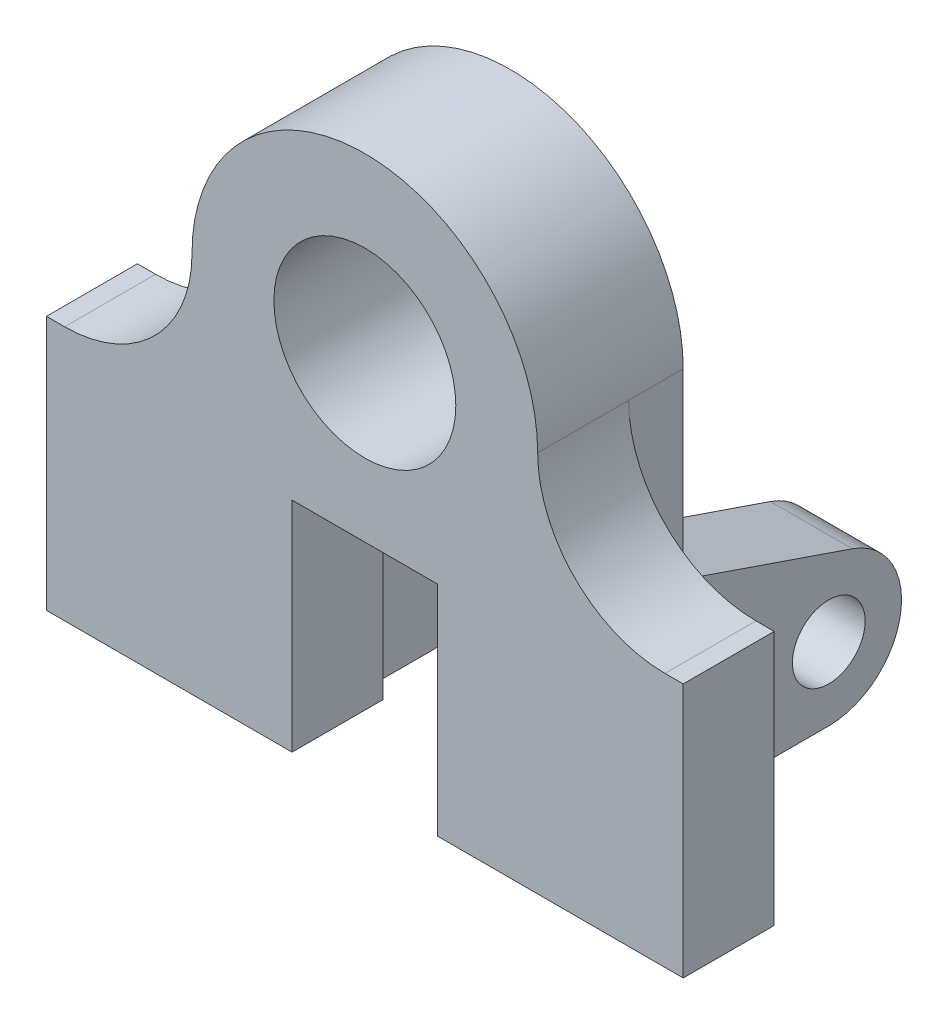
ISO-10303-21;
HEADER;
FILE_DESCRIPTION(('STEP AP214'),'2;1');
FILE_NAME('part.step','',(''),(''),'','','');
FILE_SCHEMA(('AUTOMOTIVE_DESIGN { 1 0 10303 214 1 1 1 1 }'));
ENDSEC;
DATA;
#1=APPLICATION_CONTEXT('core data for automotive mechanical design processes');
#2=APPLICATION_PROTOCOL_DEFINITION('international standard','automotive_design',2000,#1);
#3=PRODUCT_CONTEXT('',#1,'mechanical');
#4=PRODUCT('Part','Part','',(#3));
#5=PRODUCT_RELATED_PRODUCT_CATEGORY('part','',(#4));
#6=PRODUCT_DEFINITION_FORMATION('','',#4);
#7=PRODUCT_DEFINITION_CONTEXT('part definition',#1,'design');
#8=PRODUCT_DEFINITION('design','',#6,#7);
#9=PRODUCT_DEFINITION_SHAPE('','',#8);
#10=(LENGTH_UNIT() NAMED_UNIT(*) SI_UNIT(.MILLI.,.METRE.));
#11=(NAMED_UNIT(*) PLANE_ANGLE_UNIT() SI_UNIT($,.RADIAN.));
#12=(NAMED_UNIT(*) SI_UNIT($,.STERADIAN.) SOLID_ANGLE_UNIT());
#13=UNCERTAINTY_MEASURE_WITH_UNIT(LENGTH_MEASURE(1.E-05),#10,'distance_accuracy_value','');
#14=(GEOMETRIC_REPRESENTATION_CONTEXT(3) GLOBAL_UNCERTAINTY_ASSIGNED_CONTEXT((#13)) GLOBAL_UNIT_ASSIGNED_CONTEXT((#10,
#11,#12)) REPRESENTATION_CONTEXT('',''));
#15=CARTESIAN_POINT('',(0.,0.,0.));
#16=DIRECTION('',(0.,0.,1.));
#17=DIRECTION('',(1.,0.,0.));
#18=AXIS2_PLACEMENT_3D('',#15,#16,#17);
#19=CARTESIAN_POINT('',(0.,0.,-10.));
#20=DIRECTION('',(0.,0.,1.));
#21=DIRECTION('',(1.,0.,0.));
#22=AXIS2_PLACEMENT_3D('',#19,#20,#21);
#23=PLANE('',#22);
#24=DIRECTION('',(0.,-1.,0.));
#25=VECTOR('',#24,1.);
#26=CARTESIAN_POINT('',(108.,27.9999999999997,-10.));
#27=LINE('',#26,#25);
#28=CARTESIAN_POINT('',(108.,27.9999999999997,-10.));
#29=VERTEX_POINT('',#28);
#30=CARTESIAN_POINT('',(108.,-8.00000000000001,-10.));
#31=VERTEX_POINT('',#30);
#32=EDGE_CURVE('E501',#29,#31,#27,.T.);
#33=ORIENTED_EDGE('',*,*,#32,.F.);
#34=CARTESIAN_POINT('',(136.,28.,-10.));
#35=DIRECTION('',(0.,0.,1.));
#36=DIRECTION('',(1.,0.,0.));
#37=AXIS2_PLACEMENT_3D('',#34,#35,#36);
#38=CIRCLE('',#37,28.);
#39=CARTESIAN_POINT('',(136.,0.,-10.));
#40=VERTEX_POINT('',#39);
#41=EDGE_CURVE('E427',#29,#40,#38,.T.);
#42=ORIENTED_EDGE('',*,*,#41,.T.);
#43=DIRECTION('',(1.,0.,0.));
#44=VECTOR('',#43,1.);
#45=CARTESIAN_POINT('',(0.,0.,-10.));
#46=LINE('',#45,#44);
#47=CARTESIAN_POINT('',(140.,0.,-10.));
#48=VERTEX_POINT('',#47);
#49=EDGE_CURVE('E369',#40,#48,#46,.T.);
#50=ORIENTED_EDGE('',*,*,#49,.T.);
#51=DIRECTION('',(0.,-1.,0.));
#52=VECTOR('',#51,1.);
#53=CARTESIAN_POINT('',(140.,0.,-10.));
#54=LINE('',#53,#52);
#55=CARTESIAN_POINT('',(140.,-56.,-10.));
#56=VERTEX_POINT('',#55);
#57=EDGE_CURVE('E400',#48,#56,#54,.T.);
#58=ORIENTED_EDGE('',*,*,#57,.T.);
#59=DIRECTION('',(-1.,0.,0.));
#60=VECTOR('',#59,1.);
#61=CARTESIAN_POINT('',(0.,-56.0000000000001,-10.));
#62=LINE('',#61,#60);
#63=CARTESIAN_POINT('',(108.,-56.,-10.));
#64=VERTEX_POINT('',#63);
#65=EDGE_CURVE('E397',#56,#64,#62,.T.);
#66=ORIENTED_EDGE('',*,*,#65,.T.);
#67=DIRECTION('',(0.,1.,0.));
#68=VECTOR('',#67,1.);
#69=CARTESIAN_POINT('',(108.,0.,-10.));
#70=LINE('',#69,#68);
#71=EDGE_CURVE('E332',#64,#31,#70,.T.);
#72=ORIENTED_EDGE('',*,*,#71,.T.);
#73=EDGE_LOOP('',(#33,#42,#50,#58,#66,#72));
#74=FACE_BOUND('',#73,.T.);
#75=ADVANCED_FACE('F101',(#74),#23,.F.);
#76=DIRECTION('',(-1.,0.,0.));
#77=VECTOR('',#76,1.);
#78=CARTESIAN_POINT('',(108.,-8.00000000000001,-10.));
#79=LINE('',#78,#77);
#80=CARTESIAN_POINT('',(90.,-8.00000000000001,-10.));
#81=VERTEX_POINT('',#80);
#82=CARTESIAN_POINT('',(86.,-8.00000000000001,-10.));
#83=VERTEX_POINT('',#82);
#84=EDGE_CURVE('E462',#81,#83,#79,.T.);
#85=ORIENTED_EDGE('',*,*,#84,.F.);
#86=DIRECTION('',(0.,-1.,0.));
#87=VECTOR('',#86,1.);
#88=CARTESIAN_POINT('',(90.,0.,-10.));
#89=LINE('',#88,#87);
#90=CARTESIAN_POINT('',(90.,-56.,-10.));
#91=VERTEX_POINT('',#90);
#92=EDGE_CURVE('E335',#81,#91,#89,.T.);
#93=ORIENTED_EDGE('',*,*,#92,.T.);
#94=CARTESIAN_POINT('',(86.,-56.,-10.));
#95=VERTEX_POINT('',#94);
#96=EDGE_CURVE('E396',#91,#95,#62,.T.);
#97=ORIENTED_EDGE('',*,*,#96,.T.);
#98=DIRECTION('',(0.,-1.,0.));
#99=VECTOR('',#98,1.);
#100=CARTESIAN_POINT('',(86.,0.,-10.));
#101=LINE('',#100,#99);
#102=EDGE_CURVE('E354',#83,#95,#101,.T.);
#103=ORIENTED_EDGE('',*,*,#102,.F.);
#104=EDGE_LOOP('',(#85,#93,#97,#103));
#105=FACE_BOUND('',#104,.T.);
#106=ADVANCED_FACE('F461',(#105),#23,.F.);
#107=CARTESIAN_POINT('',(54.,-8.00000000000001,-10.));
#108=VERTEX_POINT('',#107);
#109=CARTESIAN_POINT('',(50.,-8.00000000000001,-10.));
#110=VERTEX_POINT('',#109);
#111=EDGE_CURVE('E465',#108,#110,#79,.T.);
#112=ORIENTED_EDGE('',*,*,#111,.F.);
#113=DIRECTION('',(0.,-1.,0.));
#114=VECTOR('',#113,1.);
#115=CARTESIAN_POINT('',(54.,-8.00000000000001,-10.));
#116=LINE('',#115,#114);
#117=CARTESIAN_POINT('',(54.,-56.,-10.));
#118=VERTEX_POINT('',#117);
#119=EDGE_CURVE('E347',#108,#118,#116,.T.);
#120=ORIENTED_EDGE('',*,*,#119,.T.);
#121=DIRECTION('',(-1.,0.,0.));
#122=VECTOR('',#121,1.);
#123=CARTESIAN_POINT('',(0.,-56.,-10.));
#124=LINE('',#123,#122);
#125=CARTESIAN_POINT('',(50.,-56.,-10.));
#126=VERTEX_POINT('',#125);
#127=EDGE_CURVE('E394',#118,#126,#124,.T.);
#128=ORIENTED_EDGE('',*,*,#127,.T.);
#129=DIRECTION('',(0.,-1.,0.));
#130=VECTOR('',#129,1.);
#131=CARTESIAN_POINT('',(50.,0.,-10.));
#132=LINE('',#131,#130);
#133=EDGE_CURVE('E314',#110,#126,#132,.T.);
#134=ORIENTED_EDGE('',*,*,#133,.F.);
#135=EDGE_LOOP('',(#112,#120,#128,#134));
#136=FACE_BOUND('',#135,.T.);
#137=ADVANCED_FACE('F498',(#136),#23,.F.);
#138=DIRECTION('',(0.,1.,0.));
#139=VECTOR('',#138,1.);
#140=CARTESIAN_POINT('',(32.,-8.00000000000001,-10.));
#141=LINE('',#140,#139);
#142=CARTESIAN_POINT('',(32.,-8.00000000000001,-10.));
#143=VERTEX_POINT('',#142);
#144=CARTESIAN_POINT('',(32.,28.,-10.));
#145=VERTEX_POINT('',#144);
#146=EDGE_CURVE('E273',#143,#145,#141,.T.);
#147=ORIENTED_EDGE('',*,*,#146,.F.);
#148=DIRECTION('',(0.,1.,0.));
#149=VECTOR('',#148,1.);
#150=CARTESIAN_POINT('',(32.,0.,-10.));
#151=LINE('',#150,#149);
#152=CARTESIAN_POINT('',(32.,-56.,-10.));
#153=VERTEX_POINT('',#152);
#154=EDGE_CURVE('E308',#153,#143,#151,.T.);
#155=ORIENTED_EDGE('',*,*,#154,.F.);
#156=CARTESIAN_POINT('',(0.,-56.,-10.));
#157=VERTEX_POINT('',#156);
#158=EDGE_CURVE('E393',#153,#157,#124,.T.);
#159=ORIENTED_EDGE('',*,*,#158,.T.);
#160=DIRECTION('',(0.,1.,0.));
#161=VECTOR('',#160,1.);
#162=CARTESIAN_POINT('',(0.,0.,-10.));
#163=LINE('',#162,#161);
#164=CARTESIAN_POINT('',(0.,0.,-10.));
#165=VERTEX_POINT('',#164);
#166=EDGE_CURVE('E390',#157,#165,#163,.T.);
#167=ORIENTED_EDGE('',*,*,#166,.T.);
#168=DIRECTION('',(1.,0.,0.));
#169=VECTOR('',#168,1.);
#170=CARTESIAN_POINT('',(0.,0.,-10.));
#171=LINE('',#170,#169);
#172=CARTESIAN_POINT('',(4.,0.,-10.));
#173=VERTEX_POINT('',#172);
#174=EDGE_CURVE('E363',#165,#173,#171,.T.);
#175=ORIENTED_EDGE('',*,*,#174,.T.);
#176=CARTESIAN_POINT('',(4.,28.,-10.));
#177=DIRECTION('',(0.,0.,1.));
#178=DIRECTION('',(1.,0.,0.));
#179=AXIS2_PLACEMENT_3D('',#176,#177,#178);
#180=CIRCLE('',#179,28.);
#181=EDGE_CURVE('E422',#173,#145,#180,.T.);
#182=ORIENTED_EDGE('',*,*,#181,.T.);
#183=EDGE_LOOP('',(#147,#155,#159,#167,#175,#182));
#184=FACE_BOUND('',#183,.T.);
#185=ADVANCED_FACE('F520',(#184),#23,.F.);
#186=CARTESIAN_POINT('',(32.,0.,-70.));
#187=DIRECTION('',(1.,0.,0.));
#188=DIRECTION('',(0.,0.,-1.));
#189=AXIS2_PLACEMENT_3D('',#186,#187,#188);
#190=PLANE('',#189);
#191=CARTESIAN_POINT('',(32.,-40.,-54.));
#192=DIRECTION('',(1.,0.,0.));
#193=DIRECTION('',(0.,0.,-1.));
#194=AXIS2_PLACEMENT_3D('',#191,#192,#193);
#195=CIRCLE('',#194,8.);
#196=CARTESIAN_POINT('',(32.,-40.,-62.));
#197=VERTEX_POINT('',#196);
#198=EDGE_CURVE('E293',#197,#197,#195,.T.);
#199=ORIENTED_EDGE('',*,*,#198,.T.);
#200=EDGE_LOOP('',(#199));
#201=FACE_BOUND('',#200,.T.);
#202=CARTESIAN_POINT('',(32.,-40.,-54.));
#203=DIRECTION('',(-1.,0.,0.));
#204=DIRECTION('',(0.,0.,1.));
#205=AXIS2_PLACEMENT_3D('',#202,#203,#204);
#206=CIRCLE('',#205,16.);
#207=CARTESIAN_POINT('',(32.,-24.8648648648649,-59.1891891891892));
#208=VERTEX_POINT('',#207);
#209=CARTESIAN_POINT('',(32.,-56.,-54.));
#210=VERTEX_POINT('',#209);
#211=EDGE_CURVE('E299',#208,#210,#206,.T.);
#212=ORIENTED_EDGE('',*,*,#211,.T.);
#213=DIRECTION('',(0.,0.,1.));
#214=VECTOR('',#213,1.);
#215=CARTESIAN_POINT('',(32.,-56.,-70.));
#216=LINE('',#215,#214);
#217=EDGE_CURVE('E317',#210,#153,#216,.T.);
#218=ORIENTED_EDGE('',*,*,#217,.T.);
#219=ORIENTED_EDGE('',*,*,#154,.T.);
#220=DIRECTION('',(0.,-0.324324324324324,-0.945945945945946));
#221=VECTOR('',#220,1.);
#222=CARTESIAN_POINT('',(32.,-4.09057706355004,1.40248356464573));
#223=LINE('',#222,#221);
#224=EDGE_CURVE('E301',#143,#208,#223,.T.);
#225=ORIENTED_EDGE('',*,*,#224,.T.);
#226=EDGE_LOOP('',(#212,#218,#219,#225));
#227=FACE_BOUND('',#226,.T.);
#228=ADVANCED_FACE('F517',(#201,#227),#190,.F.);
#229=CARTESIAN_POINT('',(50.,0.,-70.));
#230=DIRECTION('',(-1.,0.,0.));
#231=DIRECTION('',(0.,-1.,0.));
#232=AXIS2_PLACEMENT_3D('',#229,#230,#231);
#233=PLANE('',#232);
#234=CARTESIAN_POINT('',(50.,-40.,-54.));
#235=DIRECTION('',(-1.,0.,0.));
#236=DIRECTION('',(0.,-1.,0.));
#237=AXIS2_PLACEMENT_3D('',#234,#235,#236);
#238=CIRCLE('',#237,8.);
#239=CARTESIAN_POINT('',(50.,-40.,-62.));
#240=VERTEX_POINT('',#239);
#241=EDGE_CURVE('E290',#240,#240,#238,.T.);
#242=ORIENTED_EDGE('',*,*,#241,.T.);
#243=EDGE_LOOP('',(#242));
#244=FACE_BOUND('',#243,.T.);
#245=DIRECTION('',(0.,0.,1.));
#246=VECTOR('',#245,1.);
#247=CARTESIAN_POINT('',(50.,-56.,-70.));
#248=LINE('',#247,#246);
#249=CARTESIAN_POINT('',(50.0000000000001,-56.,-54.));
#250=VERTEX_POINT('',#249);
#251=EDGE_CURVE('E118',#250,#126,#248,.T.);
#252=ORIENTED_EDGE('',*,*,#251,.F.);
#253=CARTESIAN_POINT('',(50.,-40.,-54.));
#254=DIRECTION('',(-1.,0.,0.));
#255=DIRECTION('',(0.,-1.,0.));
#256=AXIS2_PLACEMENT_3D('',#253,#254,#255);
#257=CIRCLE('',#256,16.);
#258=CARTESIAN_POINT('',(50.,-24.8648648648649,-59.1891891891892));
#259=VERTEX_POINT('',#258);
#260=EDGE_CURVE('E306',#259,#250,#257,.T.);
#261=ORIENTED_EDGE('',*,*,#260,.F.);
#262=DIRECTION('',(0.,-0.324324324324324,-0.945945945945946));
#263=VECTOR('',#262,1.);
#264=CARTESIAN_POINT('',(50.,-25.5661066471877,-61.2344777209642));
#265=LINE('',#264,#263);
#266=EDGE_CURVE('E12',#110,#259,#265,.T.);
#267=ORIENTED_EDGE('',*,*,#266,.F.);
#268=ORIENTED_EDGE('',*,*,#133,.T.);
#269=EDGE_LOOP('',(#252,#261,#267,#268));
#270=FACE_BOUND('',#269,.T.);
#271=ADVANCED_FACE('F509',(#244,#270),#233,.F.);
#272=CARTESIAN_POINT('',(108.,0.,-70.));
#273=DIRECTION('',(1.,0.,0.));
#274=DIRECTION('',(0.,0.,-1.));
#275=AXIS2_PLACEMENT_3D('',#272,#273,#274);
#276=PLANE('',#275);
#277=CARTESIAN_POINT('',(108.,-40.,-54.));
#278=DIRECTION('',(1.,0.,0.));
#279=DIRECTION('',(0.,0.,-1.));
#280=AXIS2_PLACEMENT_3D('',#277,#278,#279);
#281=CIRCLE('',#280,8.);
#282=CARTESIAN_POINT('',(108.,-40.,-62.));
#283=VERTEX_POINT('',#282);
#284=EDGE_CURVE('E282',#283,#283,#281,.T.);
#285=ORIENTED_EDGE('',*,*,#284,.F.);
#286=EDGE_LOOP('',(#285));
#287=FACE_BOUND('',#286,.T.);
#288=DIRECTION('',(0.,0.,1.));
#289=VECTOR('',#288,1.);
#290=CARTESIAN_POINT('',(108.,-56.,-70.));
#291=LINE('',#290,#289);
#292=CARTESIAN_POINT('',(108.,-56.,-54.));
#293=VERTEX_POINT('',#292);
#294=EDGE_CURVE('E340',#293,#64,#291,.T.);
#295=ORIENTED_EDGE('',*,*,#294,.F.);
#296=CARTESIAN_POINT('',(108.,-40.,-54.));
#297=DIRECTION('',(1.,0.,0.));
#298=DIRECTION('',(0.,0.,-1.));
#299=AXIS2_PLACEMENT_3D('',#296,#297,#298);
#300=CIRCLE('',#299,16.);
#301=CARTESIAN_POINT('',(108.,-24.8648648648649,-59.1891891891892));
#302=VERTEX_POINT('',#301);
#303=EDGE_CURVE('E320',#293,#302,#300,.T.);
#304=ORIENTED_EDGE('',*,*,#303,.T.);
#305=DIRECTION('',(0.,-0.324324324324325,-0.945945945945946));
#306=VECTOR('',#305,1.);
#307=CARTESIAN_POINT('',(108.,-4.09057706355004,1.40248356464573));
#308=LINE('',#307,#306);
#309=EDGE_CURVE('E323',#31,#302,#308,.T.);
#310=ORIENTED_EDGE('',*,*,#309,.F.);
#311=ORIENTED_EDGE('',*,*,#71,.F.);
#312=EDGE_LOOP('',(#295,#304,#310,#311));
#313=FACE_BOUND('',#312,.T.);
#314=ADVANCED_FACE('F444',(#287,#313),#276,.T.);
#315=CARTESIAN_POINT('',(90.,0.,-70.));
#316=DIRECTION('',(-1.,0.,0.));
#317=DIRECTION('',(0.,0.,1.));
#318=AXIS2_PLACEMENT_3D('',#315,#316,#317);
#319=PLANE('',#318);
#320=CARTESIAN_POINT('',(90.,-40.,-54.));
#321=DIRECTION('',(-1.,0.,0.));
#322=DIRECTION('',(0.,0.,1.));
#323=AXIS2_PLACEMENT_3D('',#320,#321,#322);
#324=CIRCLE('',#323,8.);
#325=CARTESIAN_POINT('',(90.,-40.,-46.));
#326=VERTEX_POINT('',#325);
#327=EDGE_CURVE('E289',#326,#326,#324,.T.);
#328=ORIENTED_EDGE('',*,*,#327,.F.);
#329=EDGE_LOOP('',(#328));
#330=FACE_BOUND('',#329,.T.);
#331=CARTESIAN_POINT('',(90.,-40.,-54.));
#332=DIRECTION('',(-1.,0.,0.));
#333=DIRECTION('',(0.,0.,1.));
#334=AXIS2_PLACEMENT_3D('',#331,#332,#333);
#335=CIRCLE('',#334,16.);
#336=CARTESIAN_POINT('',(90.,-24.8648648648649,-59.1891891891892));
#337=VERTEX_POINT('',#336);
#338=CARTESIAN_POINT('',(90.,-56.,-54.));
#339=VERTEX_POINT('',#338);
#340=EDGE_CURVE('E328',#337,#339,#335,.T.);
#341=ORIENTED_EDGE('',*,*,#340,.T.);
#342=DIRECTION('',(0.,0.,1.));
#343=VECTOR('',#342,1.);
#344=CARTESIAN_POINT('',(90.,-56.,-70.));
#345=LINE('',#344,#343);
#346=EDGE_CURVE('E338',#339,#91,#345,.T.);
#347=ORIENTED_EDGE('',*,*,#346,.T.);
#348=ORIENTED_EDGE('',*,*,#92,.F.);
#349=DIRECTION('',(0.,0.324324324324325,0.945945945945946));
#350=VECTOR('',#349,1.);
#351=CARTESIAN_POINT('',(90.,-25.5661066471878,-61.2344777209642));
#352=LINE('',#351,#350);
#353=EDGE_CURVE('E431',#337,#81,#352,.T.);
#354=ORIENTED_EDGE('',*,*,#353,.F.);
#355=EDGE_LOOP('',(#341,#347,#348,#354));
#356=FACE_BOUND('',#355,.T.);
#357=ADVANCED_FACE('F440',(#330,#356),#319,.T.);
#358=CARTESIAN_POINT('',(0.,-56.0000000000001,10.));
#359=DIRECTION('',(0.,-1.,0.));
#360=DIRECTION('',(1.,0.,0.));
#361=AXIS2_PLACEMENT_3D('',#358,#359,#360);
#362=PLANE('',#361);
#363=ORIENTED_EDGE('',*,*,#346,.F.);
#364=DIRECTION('',(1.,0.,0.));
#365=VECTOR('',#364,1.);
#366=CARTESIAN_POINT('',(48.,-56.,-54.));
#367=LINE('',#366,#365);
#368=EDGE_CURVE('E110',#339,#293,#367,.T.);
#369=ORIENTED_EDGE('',*,*,#368,.T.);
#370=ORIENTED_EDGE('',*,*,#294,.T.);
#371=ORIENTED_EDGE('',*,*,#65,.F.);
#372=DIRECTION('',(0.,0.,-1.));
#373=VECTOR('',#372,1.);
#374=CARTESIAN_POINT('',(140.,-56.,10.));
#375=LINE('',#374,#373);
#376=CARTESIAN_POINT('',(140.,-56.,10.));
#377=VERTEX_POINT('',#376);
#378=EDGE_CURVE('E408',#377,#56,#375,.T.);
#379=ORIENTED_EDGE('',*,*,#378,.F.);
#380=DIRECTION('',(-1.,0.,0.));
#381=VECTOR('',#380,1.);
#382=CARTESIAN_POINT('',(0.,-56.0000000000001,10.));
#383=LINE('',#382,#381);
#384=CARTESIAN_POINT('',(86.,-56.,10.));
#385=VERTEX_POINT('',#384);
#386=EDGE_CURVE('E381',#377,#385,#383,.T.);
#387=ORIENTED_EDGE('',*,*,#386,.T.);
#388=DIRECTION('',(0.,0.,1.));
#389=VECTOR('',#388,1.);
#390=CARTESIAN_POINT('',(86.,-56.,-10.));
#391=LINE('',#390,#389);
#392=EDGE_CURVE('E360',#95,#385,#391,.T.);
#393=ORIENTED_EDGE('',*,*,#392,.F.);
#394=ORIENTED_EDGE('',*,*,#96,.F.);
#395=EDGE_LOOP('',(#363,#369,#370,#371,#379,#387,#393,#394));
#396=FACE_BOUND('',#395,.T.);
#397=ADVANCED_FACE('F443',(#396),#362,.T.);
#398=CARTESIAN_POINT('',(0.,-8.00000000000002,10.));
#399=DIRECTION('',(0.,-1.,0.));
#400=DIRECTION('',(1.,0.,0.));
#401=AXIS2_PLACEMENT_3D('',#398,#399,#400);
#402=PLANE('',#401);
#403=DIRECTION('',(-1.,0.,0.));
#404=VECTOR('',#403,1.);
#405=CARTESIAN_POINT('',(0.,-8.00000000000002,10.));
#406=LINE('',#405,#404);
#407=CARTESIAN_POINT('',(86.,-8.00000000000001,10.));
#408=VERTEX_POINT('',#407);
#409=CARTESIAN_POINT('',(54.,-8.00000000000001,10.));
#410=VERTEX_POINT('',#409);
#411=EDGE_CURVE('E378',#408,#410,#406,.T.);
#412=ORIENTED_EDGE('',*,*,#411,.T.);
#413=DIRECTION('',(0.,0.,1.));
#414=VECTOR('',#413,1.);
#415=CARTESIAN_POINT('',(54.,-8.00000000000001,-10.));
#416=LINE('',#415,#414);
#417=EDGE_CURVE('E342',#108,#410,#416,.T.);
#418=ORIENTED_EDGE('',*,*,#417,.F.);
#419=ORIENTED_EDGE('',*,*,#111,.T.);
#420=DIRECTION('',(1.,0.,0.));
#421=VECTOR('',#420,1.);
#422=CARTESIAN_POINT('',(0.,-8.,-10.));
#423=LINE('',#422,#421);
#424=EDGE_CURVE('E311',#143,#110,#423,.T.);
#425=ORIENTED_EDGE('',*,*,#424,.F.);
#426=DIRECTION('',(0.,0.,1.));
#427=VECTOR('',#426,1.);
#428=CARTESIAN_POINT('',(32.,-8.00000000000001,-22.));
#429=LINE('',#428,#427);
#430=CARTESIAN_POINT('',(32.,-8.00000000000001,-22.));
#431=VERTEX_POINT('',#430);
#432=EDGE_CURVE('E283',#431,#143,#429,.T.);
#433=ORIENTED_EDGE('',*,*,#432,.F.);
#434=DIRECTION('',(-1.,0.,0.));
#435=VECTOR('',#434,1.);
#436=CARTESIAN_POINT('',(108.,-8.00000000000001,-22.));
#437=LINE('',#436,#435);
#438=CARTESIAN_POINT('',(108.,-8.00000000000001,-22.));
#439=VERTEX_POINT('',#438);
#440=EDGE_CURVE('E262',#439,#431,#437,.T.);
#441=ORIENTED_EDGE('',*,*,#440,.F.);
#442=DIRECTION('',(0.,0.,1.));
#443=VECTOR('',#442,1.);
#444=CARTESIAN_POINT('',(108.,-8.00000000000001,-22.));
#445=LINE('',#444,#443);
#446=EDGE_CURVE('E259',#439,#31,#445,.T.);
#447=ORIENTED_EDGE('',*,*,#446,.T.);
#448=DIRECTION('',(-1.,0.,0.));
#449=VECTOR('',#448,1.);
#450=CARTESIAN_POINT('',(0.,-8.00000000000001,-10.));
#451=LINE('',#450,#449);
#452=EDGE_CURVE('E330',#31,#81,#451,.T.);
#453=ORIENTED_EDGE('',*,*,#452,.T.);
#454=ORIENTED_EDGE('',*,*,#84,.T.);
#455=DIRECTION('',(0.,0.,1.));
#456=VECTOR('',#455,1.);
#457=CARTESIAN_POINT('',(86.,-8.00000000000001,-10.));
#458=LINE('',#457,#456);
#459=EDGE_CURVE('E357',#83,#408,#458,.T.);
#460=ORIENTED_EDGE('',*,*,#459,.T.);
#461=EDGE_LOOP('',(#412,#418,#419,#425,#433,#441,#447,#453,#454,#460));
#462=FACE_BOUND('',#461,.T.);
#463=ADVANCED_FACE('F487',(#462),#402,.T.);
#464=CARTESIAN_POINT('',(70.,28.,10.));
#465=DIRECTION('',(0.,0.,-1.));
#466=DIRECTION('',(-1.,0.,0.));
#467=AXIS2_PLACEMENT_3D('',#464,#465,#466);
#468=CYLINDRICAL_SURFACE('',#467,38.);
#469=DIRECTION('',(0.,0.,-1.));
#470=VECTOR('',#469,1.);
#471=CARTESIAN_POINT('',(108.,28.,10.));
#472=LINE('',#471,#470);
#473=CARTESIAN_POINT('',(108.,28.,10.));
#474=VERTEX_POINT('',#473);
#475=EDGE_CURVE('E279',#474,#29,#472,.T.);
#476=ORIENTED_EDGE('',*,*,#475,.T.);
#477=DIRECTION('',(0.,0.,1.));
#478=VECTOR('',#477,1.);
#479=CARTESIAN_POINT('',(108.,27.9999999999997,-22.));
#480=LINE('',#479,#478);
#481=CARTESIAN_POINT('',(108.,27.9999999999997,-22.));
#482=VERTEX_POINT('',#481);
#483=EDGE_CURVE('E256',#482,#29,#480,.T.);
#484=ORIENTED_EDGE('',*,*,#483,.F.);
#485=CARTESIAN_POINT('',(70.,27.9999999999999,-22.));
#486=DIRECTION('',(0.,0.,-1.));
#487=DIRECTION('',(-1.,0.,0.));
#488=AXIS2_PLACEMENT_3D('',#485,#486,#487);
#489=CIRCLE('',#488,38.);
#490=CARTESIAN_POINT('',(32.,28.,-22.));
#491=VERTEX_POINT('',#490);
#492=EDGE_CURVE('E263',#491,#482,#489,.T.);
#493=ORIENTED_EDGE('',*,*,#492,.F.);
#494=DIRECTION('',(0.,0.,1.));
#495=VECTOR('',#494,1.);
#496=CARTESIAN_POINT('',(32.,28.,-22.));
#497=LINE('',#496,#495);
#498=EDGE_CURVE('E525',#491,#145,#497,.T.);
#499=ORIENTED_EDGE('',*,*,#498,.T.);
#500=DIRECTION('',(0.,0.,-1.));
#501=VECTOR('',#500,1.);
#502=CARTESIAN_POINT('',(32.,28.,10.));
#503=LINE('',#502,#501);
#504=CARTESIAN_POINT('',(32.,28.,10.));
#505=VERTEX_POINT('',#504);
#506=EDGE_CURVE('E415',#505,#145,#503,.T.);
#507=ORIENTED_EDGE('',*,*,#506,.F.);
#508=CARTESIAN_POINT('',(70.,28.,10.));
#509=DIRECTION('',(0.,0.,1.));
#510=DIRECTION('',(1.,0.,0.));
#511=AXIS2_PLACEMENT_3D('',#508,#509,#510);
#512=CIRCLE('',#511,38.);
#513=EDGE_CURVE('E366',#505,#474,#512,.F.);
#514=ORIENTED_EDGE('',*,*,#513,.T.);
#515=EDGE_LOOP('',(#476,#484,#493,#499,#507,#514));
#516=FACE_BOUND('',#515,.T.);
#517=ADVANCED_FACE('F276',(#516),#468,.T.);
#518=CARTESIAN_POINT('',(0.,0.,10.));
#519=DIRECTION('',(0.,1.,0.));
#520=DIRECTION('',(0.,0.,1.));
#521=AXIS2_PLACEMENT_3D('',#518,#519,#520);
#522=PLANE('',#521);
#523=DIRECTION('',(1.,0.,0.));
#524=VECTOR('',#523,1.);
#525=CARTESIAN_POINT('',(0.,0.,10.));
#526=LINE('',#525,#524);
#527=CARTESIAN_POINT('',(0.,0.,10.));
#528=VERTEX_POINT('',#527);
#529=CARTESIAN_POINT('',(4.,0.,10.));
#530=VERTEX_POINT('',#529);
#531=EDGE_CURVE('E368',#528,#530,#526,.T.);
#532=ORIENTED_EDGE('',*,*,#531,.T.);
#533=DIRECTION('',(0.,0.,-1.));
#534=VECTOR('',#533,1.);
#535=CARTESIAN_POINT('',(4.,0.,-10.));
#536=LINE('',#535,#534);
#537=EDGE_CURVE('E418',#530,#173,#536,.T.);
#538=ORIENTED_EDGE('',*,*,#537,.T.);
#539=ORIENTED_EDGE('',*,*,#174,.F.);
#540=DIRECTION('',(0.,0.,-1.));
#541=VECTOR('',#540,1.);
#542=CARTESIAN_POINT('',(0.,0.,10.));
#543=LINE('',#542,#541);
#544=EDGE_CURVE('E413',#528,#165,#543,.T.);
#545=ORIENTED_EDGE('',*,*,#544,.F.);
#546=EDGE_LOOP('',(#532,#538,#539,#545));
#547=FACE_BOUND('',#546,.T.);
#548=ADVANCED_FACE('F664',(#547),#522,.T.);
#549=CARTESIAN_POINT('',(0.,0.,10.));
#550=DIRECTION('',(-1.,0.,0.));
#551=DIRECTION('',(0.,0.,1.));
#552=AXIS2_PLACEMENT_3D('',#549,#550,#551);
#553=PLANE('',#552);
#554=ORIENTED_EDGE('',*,*,#166,.F.);
#555=DIRECTION('',(0.,0.,-1.));
#556=VECTOR('',#555,1.);
#557=CARTESIAN_POINT('',(0.,-56.,10.));
#558=LINE('',#557,#556);
#559=CARTESIAN_POINT('',(0.,-56.,10.));
#560=VERTEX_POINT('',#559);
#561=EDGE_CURVE('E410',#560,#157,#558,.T.);
#562=ORIENTED_EDGE('',*,*,#561,.F.);
#563=DIRECTION('',(0.,1.,0.));
#564=VECTOR('',#563,1.);
#565=CARTESIAN_POINT('',(0.,0.,10.));
#566=LINE('',#565,#564);
#567=EDGE_CURVE('E372',#560,#528,#566,.T.);
#568=ORIENTED_EDGE('',*,*,#567,.T.);
#569=ORIENTED_EDGE('',*,*,#544,.T.);
#570=EDGE_LOOP('',(#554,#562,#568,#569));
#571=FACE_BOUND('',#570,.T.);
#572=ADVANCED_FACE('F636',(#571),#553,.T.);
#573=CARTESIAN_POINT('',(0.,-56.,10.));
#574=DIRECTION('',(0.,-1.,0.));
#575=DIRECTION('',(1.,0.,0.));
#576=AXIS2_PLACEMENT_3D('',#573,#574,#575);
#577=PLANE('',#576);
#578=DIRECTION('',(-1.,0.,0.));
#579=VECTOR('',#578,1.);
#580=CARTESIAN_POINT('',(92.,-56.,-54.));
#581=LINE('',#580,#579);
#582=EDGE_CURVE('E296',#250,#210,#581,.T.);
#583=ORIENTED_EDGE('',*,*,#582,.F.);
#584=ORIENTED_EDGE('',*,*,#251,.T.);
#585=ORIENTED_EDGE('',*,*,#127,.F.);
#586=DIRECTION('',(0.,0.,1.));
#587=VECTOR('',#586,1.);
#588=CARTESIAN_POINT('',(54.,-56.,-10.));
#589=LINE('',#588,#587);
#590=CARTESIAN_POINT('',(54.,-56.,10.));
#591=VERTEX_POINT('',#590);
#592=EDGE_CURVE('E344',#118,#591,#589,.T.);
#593=ORIENTED_EDGE('',*,*,#592,.T.);
#594=DIRECTION('',(-1.,0.,0.));
#595=VECTOR('',#594,1.);
#596=CARTESIAN_POINT('',(0.,-56.,10.));
#597=LINE('',#596,#595);
#598=EDGE_CURVE('E375',#591,#560,#597,.T.);
#599=ORIENTED_EDGE('',*,*,#598,.T.);
#600=ORIENTED_EDGE('',*,*,#561,.T.);
#601=ORIENTED_EDGE('',*,*,#158,.F.);
#602=ORIENTED_EDGE('',*,*,#217,.F.);
#603=EDGE_LOOP('',(#583,#584,#585,#593,#599,#600,#601,#602));
#604=FACE_BOUND('',#603,.T.);
#605=ADVANCED_FACE('F495',(#604),#577,.T.);
#606=CARTESIAN_POINT('',(140.,0.,10.));
#607=DIRECTION('',(1.,0.,0.));
#608=DIRECTION('',(0.,0.,-1.));
#609=AXIS2_PLACEMENT_3D('',#606,#607,#608);
#610=PLANE('',#609);
#611=ORIENTED_EDGE('',*,*,#57,.F.);
#612=DIRECTION('',(0.,0.,-1.));
#613=VECTOR('',#612,1.);
#614=CARTESIAN_POINT('',(140.,0.,10.));
#615=LINE('',#614,#613);
#616=CARTESIAN_POINT('',(140.,0.,10.));
#617=VERTEX_POINT('',#616);
#618=EDGE_CURVE('E405',#617,#48,#615,.T.);
#619=ORIENTED_EDGE('',*,*,#618,.F.);
#620=DIRECTION('',(0.,-1.,0.));
#621=VECTOR('',#620,1.);
#622=CARTESIAN_POINT('',(140.,0.,10.));
#623=LINE('',#622,#621);
#624=EDGE_CURVE('E383',#617,#377,#623,.T.);
#625=ORIENTED_EDGE('',*,*,#624,.T.);
#626=ORIENTED_EDGE('',*,*,#378,.T.);
#627=EDGE_LOOP('',(#611,#619,#625,#626));
#628=FACE_BOUND('',#627,.T.);
#629=ADVANCED_FACE('F479',(#628),#610,.T.);
#630=CARTESIAN_POINT('',(0.,0.,10.));
#631=DIRECTION('',(0.,1.,0.));
#632=DIRECTION('',(0.,0.,1.));
#633=AXIS2_PLACEMENT_3D('',#630,#631,#632);
#634=PLANE('',#633);
#635=ORIENTED_EDGE('',*,*,#49,.F.);
#636=DIRECTION('',(0.,0.,-1.));
#637=VECTOR('',#636,1.);
#638=CARTESIAN_POINT('',(136.,0.,10.));
#639=LINE('',#638,#637);
#640=CARTESIAN_POINT('',(136.,0.,10.));
#641=VERTEX_POINT('',#640);
#642=EDGE_CURVE('E126',#40,#641,#639,.F.);
#643=ORIENTED_EDGE('',*,*,#642,.T.);
#644=DIRECTION('',(1.,0.,0.));
#645=VECTOR('',#644,1.);
#646=CARTESIAN_POINT('',(0.,0.,10.));
#647=LINE('',#646,#645);
#648=EDGE_CURVE('E386',#641,#617,#647,.T.);
#649=ORIENTED_EDGE('',*,*,#648,.T.);
#650=ORIENTED_EDGE('',*,*,#618,.T.);
#651=EDGE_LOOP('',(#635,#643,#649,#650));
#652=FACE_BOUND('',#651,.T.);
#653=ADVANCED_FACE('F584',(#652),#634,.T.);
#654=CARTESIAN_POINT('',(0.,0.,10.));
#655=DIRECTION('',(0.,0.,1.));
#656=DIRECTION('',(1.,0.,0.));
#657=AXIS2_PLACEMENT_3D('',#654,#655,#656);
#658=PLANE('',#657);
#659=CARTESIAN_POINT('',(70.,28.,9.99999999999999));
#660=DIRECTION('',(0.,0.,1.));
#661=DIRECTION('',(1.,0.,0.));
#662=AXIS2_PLACEMENT_3D('',#659,#660,#661);
#663=CIRCLE('',#662,20.);
#664=CARTESIAN_POINT('',(90.,28.,9.99999999999999));
#665=VERTEX_POINT('',#664);
#666=EDGE_CURVE('E105',#665,#665,#663,.T.);
#667=ORIENTED_EDGE('',*,*,#666,.F.);
#668=EDGE_LOOP('',(#667));
#669=FACE_BOUND('',#668,.T.);
#670=ORIENTED_EDGE('',*,*,#598,.F.);
#671=DIRECTION('',(0.,-1.,0.));
#672=VECTOR('',#671,1.);
#673=CARTESIAN_POINT('',(54.,-8.00000000000001,10.));
#674=LINE('',#673,#672);
#675=EDGE_CURVE('E348',#410,#591,#674,.T.);
#676=ORIENTED_EDGE('',*,*,#675,.F.);
#677=ORIENTED_EDGE('',*,*,#411,.F.);
#678=DIRECTION('',(0.,-1.,0.));
#679=VECTOR('',#678,1.);
#680=CARTESIAN_POINT('',(86.,0.,10.));
#681=LINE('',#680,#679);
#682=EDGE_CURVE('E351',#408,#385,#681,.T.);
#683=ORIENTED_EDGE('',*,*,#682,.T.);
#684=ORIENTED_EDGE('',*,*,#386,.F.);
#685=ORIENTED_EDGE('',*,*,#624,.F.);
#686=ORIENTED_EDGE('',*,*,#648,.F.);
#687=CARTESIAN_POINT('',(136.,28.,10.));
#688=DIRECTION('',(0.,0.,1.));
#689=DIRECTION('',(1.,0.,0.));
#690=AXIS2_PLACEMENT_3D('',#687,#688,#689);
#691=CIRCLE('',#690,28.);
#692=EDGE_CURVE('E429',#641,#474,#691,.F.);
#693=ORIENTED_EDGE('',*,*,#692,.T.);
#694=ORIENTED_EDGE('',*,*,#513,.F.);
#695=CARTESIAN_POINT('',(4.,28.,10.));
#696=DIRECTION('',(0.,0.,1.));
#697=DIRECTION('',(1.,0.,0.));
#698=AXIS2_PLACEMENT_3D('',#695,#696,#697);
#699=CIRCLE('',#698,28.);
#700=EDGE_CURVE('E425',#505,#530,#699,.F.);
#701=ORIENTED_EDGE('',*,*,#700,.T.);
#702=ORIENTED_EDGE('',*,*,#531,.F.);
#703=ORIENTED_EDGE('',*,*,#567,.F.);
#704=EDGE_LOOP('',(#670,#676,#677,#683,#684,#685,#686,#693,#694,#701,#702,#703));
#705=FACE_BOUND('',#704,.T.);
#706=ADVANCED_FACE('F482',(#669,#705),#658,.T.);
#707=CARTESIAN_POINT('',(4.,28.,10.));
#708=DIRECTION('',(0.,0.,1.));
#709=DIRECTION('',(1.,0.,0.));
#710=AXIS2_PLACEMENT_3D('',#707,#708,#709);
#711=CYLINDRICAL_SURFACE('',#710,28.);
#712=ORIENTED_EDGE('',*,*,#700,.F.);
#713=ORIENTED_EDGE('',*,*,#506,.T.);
#714=ORIENTED_EDGE('',*,*,#181,.F.);
#715=ORIENTED_EDGE('',*,*,#537,.F.);
#716=EDGE_LOOP('',(#712,#713,#714,#715));
#717=FACE_BOUND('',#716,.T.);
#718=ADVANCED_FACE('F583',(#717),#711,.F.);
#719=CARTESIAN_POINT('',(136.,28.,10.));
#720=DIRECTION('',(0.,0.,1.));
#721=DIRECTION('',(1.,0.,0.));
#722=AXIS2_PLACEMENT_3D('',#719,#720,#721);
#723=CYLINDRICAL_SURFACE('',#722,28.);
#724=ORIENTED_EDGE('',*,*,#692,.F.);
#725=ORIENTED_EDGE('',*,*,#642,.F.);
#726=ORIENTED_EDGE('',*,*,#41,.F.);
#727=ORIENTED_EDGE('',*,*,#475,.F.);
#728=EDGE_LOOP('',(#724,#725,#726,#727));
#729=FACE_BOUND('',#728,.T.);
#730=ADVANCED_FACE('F103',(#729),#723,.F.);
#731=CARTESIAN_POINT('',(86.,0.,-10.));
#732=DIRECTION('',(-1.,0.,0.));
#733=DIRECTION('',(0.,0.,1.));
#734=AXIS2_PLACEMENT_3D('',#731,#732,#733);
#735=PLANE('',#734);
#736=ORIENTED_EDGE('',*,*,#682,.F.);
#737=ORIENTED_EDGE('',*,*,#459,.F.);
#738=ORIENTED_EDGE('',*,*,#102,.T.);
#739=ORIENTED_EDGE('',*,*,#392,.T.);
#740=EDGE_LOOP('',(#736,#737,#738,#739));
#741=FACE_BOUND('',#740,.T.);
#742=ADVANCED_FACE('F486',(#741),#735,.T.);
#743=CARTESIAN_POINT('',(54.,-8.00000000000001,-10.));
#744=DIRECTION('',(-1.,0.,0.));
#745=DIRECTION('',(0.,-1.,0.));
#746=AXIS2_PLACEMENT_3D('',#743,#744,#745);
#747=PLANE('',#746);
#748=ORIENTED_EDGE('',*,*,#675,.T.);
#749=ORIENTED_EDGE('',*,*,#592,.F.);
#750=ORIENTED_EDGE('',*,*,#119,.F.);
#751=ORIENTED_EDGE('',*,*,#417,.T.);
#752=EDGE_LOOP('',(#748,#749,#750,#751));
#753=FACE_BOUND('',#752,.T.);
#754=ADVANCED_FACE('F493',(#753),#747,.F.);
#755=CARTESIAN_POINT('',(48.,-40.,-54.));
#756=DIRECTION('',(1.,0.,0.));
#757=DIRECTION('',(0.,0.,-1.));
#758=AXIS2_PLACEMENT_3D('',#755,#756,#757);
#759=CYLINDRICAL_SURFACE('',#758,16.);
#760=ORIENTED_EDGE('',*,*,#368,.F.);
#761=ORIENTED_EDGE('',*,*,#340,.F.);
#762=DIRECTION('',(1.,0.,0.));
#763=VECTOR('',#762,1.);
#764=CARTESIAN_POINT('',(48.,-24.8648648648649,-59.1891891891892));
#765=LINE('',#764,#763);
#766=EDGE_CURVE('E326',#337,#302,#765,.T.);
#767=ORIENTED_EDGE('',*,*,#766,.T.);
#768=ORIENTED_EDGE('',*,*,#303,.F.);
#769=EDGE_LOOP('',(#760,#761,#767,#768));
#770=FACE_BOUND('',#769,.T.);
#771=ADVANCED_FACE('F453',(#770),#759,.T.);
#772=CARTESIAN_POINT('',(48.,-4.09057706355004,1.40248356464573));
#773=DIRECTION('',(0.,-0.945945945945946,0.324324324324325));
#774=DIRECTION('',(0.,-0.324324324324325,-0.945945945945946));
#775=AXIS2_PLACEMENT_3D('',#772,#773,#774);
#776=PLANE('',#775);
#777=ORIENTED_EDGE('',*,*,#353,.T.);
#778=ORIENTED_EDGE('',*,*,#452,.F.);
#779=ORIENTED_EDGE('',*,*,#309,.T.);
#780=ORIENTED_EDGE('',*,*,#766,.F.);
#781=EDGE_LOOP('',(#777,#778,#779,#780));
#782=FACE_BOUND('',#781,.T.);
#783=ADVANCED_FACE('F469',(#782),#776,.F.);
#784=CARTESIAN_POINT('',(92.,-4.09057706355004,1.40248356464573));
#785=DIRECTION('',(0.,0.945945945945946,-0.324324324324324));
#786=DIRECTION('',(0.,0.324324324324324,0.945945945945946));
#787=AXIS2_PLACEMENT_3D('',#784,#785,#786);
#788=PLANE('',#787);
#789=ORIENTED_EDGE('',*,*,#266,.T.);
#790=DIRECTION('',(-1.,0.,0.));
#791=VECTOR('',#790,1.);
#792=CARTESIAN_POINT('',(92.,-24.8648648648649,-59.1891891891892));
#793=LINE('',#792,#791);
#794=EDGE_CURVE('E304',#259,#208,#793,.T.);
#795=ORIENTED_EDGE('',*,*,#794,.T.);
#796=ORIENTED_EDGE('',*,*,#224,.F.);
#797=ORIENTED_EDGE('',*,*,#424,.T.);
#798=EDGE_LOOP('',(#789,#795,#796,#797));
#799=FACE_BOUND('',#798,.T.);
#800=ADVANCED_FACE('F505',(#799),#788,.T.);
#801=CARTESIAN_POINT('',(92.,-40.,-54.));
#802=DIRECTION('',(-1.,0.,0.));
#803=DIRECTION('',(0.,0.,1.));
#804=AXIS2_PLACEMENT_3D('',#801,#802,#803);
#805=CYLINDRICAL_SURFACE('',#804,16.);
#806=ORIENTED_EDGE('',*,*,#260,.T.);
#807=ORIENTED_EDGE('',*,*,#582,.T.);
#808=ORIENTED_EDGE('',*,*,#211,.F.);
#809=ORIENTED_EDGE('',*,*,#794,.F.);
#810=EDGE_LOOP('',(#806,#807,#808,#809));
#811=FACE_BOUND('',#810,.T.);
#812=ADVANCED_FACE('F511',(#811),#805,.T.);
#813=CARTESIAN_POINT('',(-32.,-40.,-54.));
#814=DIRECTION('',(1.,0.,0.));
#815=DIRECTION('',(0.,0.,-1.));
#816=AXIS2_PLACEMENT_3D('',#813,#814,#815);
#817=CYLINDRICAL_SURFACE('',#816,8.);
#818=ORIENTED_EDGE('',*,*,#327,.T.);
#819=EDGE_LOOP('',(#818));
#820=FACE_BOUND('',#819,.T.);
#821=ORIENTED_EDGE('',*,*,#284,.T.);
#822=EDGE_LOOP('',(#821));
#823=FACE_BOUND('',#822,.T.);
#824=ADVANCED_FACE('F437',(#820,#823),#817,.F.);
#825=CARTESIAN_POINT('',(50.,-40.,-62.));
#826=CARTESIAN_POINT('',(49.8125,-40.,-62.));
#827=CARTESIAN_POINT('',(49.625,-40.,-62.));
#828=CARTESIAN_POINT('',(49.25,-40.,-62.));
#829=CARTESIAN_POINT('',(49.0625,-40.,-62.));
#830=CARTESIAN_POINT('',(48.6875,-40.,-62.));
#831=CARTESIAN_POINT('',(48.5,-40.,-62.));
#832=CARTESIAN_POINT('',(48.125,-40.,-62.));
#833=CARTESIAN_POINT('',(47.9375,-40.,-62.));
#834=CARTESIAN_POINT('',(47.5625,-40.,-62.));
#835=CARTESIAN_POINT('',(47.375,-40.,-62.));
#836=CARTESIAN_POINT('',(47.,-40.,-62.));
#837=CARTESIAN_POINT('',(46.8125,-40.,-62.));
#838=CARTESIAN_POINT('',(46.4375,-40.,-62.));
#839=CARTESIAN_POINT('',(46.25,-40.,-62.));
#840=CARTESIAN_POINT('',(45.875,-40.,-62.));
#841=CARTESIAN_POINT('',(45.6875,-40.,-62.));
#842=CARTESIAN_POINT('',(45.3125,-40.,-62.));
#843=CARTESIAN_POINT('',(45.125,-40.,-62.));
#844=CARTESIAN_POINT('',(44.75,-40.,-62.));
#845=CARTESIAN_POINT('',(44.5625,-40.,-62.));
#846=CARTESIAN_POINT('',(44.1875,-40.,-62.));
#847=CARTESIAN_POINT('',(44.,-40.,-62.));
#848=CARTESIAN_POINT('',(43.625,-40.,-62.));
#849=CARTESIAN_POINT('',(43.4375,-40.,-62.));
#850=CARTESIAN_POINT('',(43.0625,-40.,-62.));
#851=CARTESIAN_POINT('',(42.875,-40.,-62.));
#852=CARTESIAN_POINT('',(42.5,-40.,-62.));
#853=CARTESIAN_POINT('',(42.3125,-40.,-62.));
#854=CARTESIAN_POINT('',(41.9375,-40.,-62.));
#855=CARTESIAN_POINT('',(41.75,-40.,-62.));
#856=CARTESIAN_POINT('',(41.375,-40.,-62.));
#857=CARTESIAN_POINT('',(41.1875,-40.,-62.));
#858=CARTESIAN_POINT('',(40.8125,-40.,-62.));
#859=CARTESIAN_POINT('',(40.625,-40.,-62.));
#860=CARTESIAN_POINT('',(40.25,-40.,-62.));
#861=CARTESIAN_POINT('',(40.0625,-40.,-62.));
#862=CARTESIAN_POINT('',(39.6875,-40.,-62.));
#863=CARTESIAN_POINT('',(39.5,-40.,-62.));
#864=CARTESIAN_POINT('',(39.125,-40.,-62.));
#865=CARTESIAN_POINT('',(38.9375,-40.,-62.));
#866=CARTESIAN_POINT('',(38.5625,-40.,-62.));
#867=CARTESIAN_POINT('',(38.375,-40.,-62.));
#868=CARTESIAN_POINT('',(38.,-40.,-62.));
#869=CARTESIAN_POINT('',(37.8125,-40.,-62.));
#870=CARTESIAN_POINT('',(37.4375,-40.,-62.));
#871=CARTESIAN_POINT('',(37.25,-40.,-62.));
#872=CARTESIAN_POINT('',(36.875,-40.,-62.));
#873=CARTESIAN_POINT('',(36.6875,-40.,-62.));
#874=CARTESIAN_POINT('',(36.3125,-40.,-62.));
#875=CARTESIAN_POINT('',(36.125,-40.,-62.));
#876=CARTESIAN_POINT('',(35.75,-40.,-62.));
#877=CARTESIAN_POINT('',(35.5625,-40.,-62.));
#878=CARTESIAN_POINT('',(35.1875,-40.,-62.));
#879=CARTESIAN_POINT('',(35.,-40.,-62.));
#880=CARTESIAN_POINT('',(34.625,-40.,-62.));
#881=CARTESIAN_POINT('',(34.4375,-40.,-62.));
#882=CARTESIAN_POINT('',(34.0625,-40.,-62.));
#883=CARTESIAN_POINT('',(33.875,-40.,-62.));
#884=CARTESIAN_POINT('',(33.5,-40.,-62.));
#885=CARTESIAN_POINT('',(33.3125,-40.,-62.));
#886=CARTESIAN_POINT('',(32.9375,-40.,-62.));
#887=CARTESIAN_POINT('',(32.75,-40.,-62.));
#888=CARTESIAN_POINT('',(32.375,-40.,-62.));
#889=CARTESIAN_POINT('',(32.1875,-40.,-62.));
#890=CARTESIAN_POINT('',(32.,-40.,-62.));
#891=B_SPLINE_CURVE_WITH_KNOTS('',3,(#825,#826,#827,#828,#829,#830,#831,#832,#833,#834,#835,
#836,#837,#838,#839,#840,#841,#842,#843,#844,#845,#846,#847,#848,#849,#850,#851,#852,#853,#854,
#855,#856,#857,#858,#859,#860,#861,#862,#863,#864,#865,#866,#867,#868,#869,#870,#871,#872,#873,
#874,#875,#876,#877,#878,#879,#880,#881,#882,#883,#884,#885,#886,#887,#888,#889,#890),
.UNSPECIFIED.,.F.,.F.,(4,2,2,2,2,2,2,2,2,2,2,2,2,2,2,2,2,2,2,2,2,2,2,2,2,2,2,2,2,2,2,2,4),(0.,
0.562499999999994,1.125,1.68750000000001,2.25,2.8125,3.375,3.93750000000001,4.5,5.0625,
5.62500000000001,6.18750000000001,6.75000000000001,7.3125,7.87500000000001,8.43750000000001,
9.00000000000001,9.5625,10.125,10.6875,11.25,11.8125,12.375,12.9375,13.5,14.0625,14.625,15.1875,
15.75,16.3125,16.875,17.4375,18.),.UNSPECIFIED.);
#892=EDGE_CURVE('BSEAM542',#240,#197,#891,.T.);
#893=ORIENTED_EDGE('',*,*,#241,.F.);
#894=ORIENTED_EDGE('',*,*,#198,.F.);
#895=ORIENTED_EDGE('',*,*,#892,.T.);
#896=ORIENTED_EDGE('',*,*,#892,.F.);
#897=EDGE_LOOP('',(#893,#895,#894,#896));
#898=FACE_BOUND('',#897,.T.);
#899=ADVANCED_FACE('F542',(#898),#817,.F.);
#900=CARTESIAN_POINT('',(70.,28.,130.));
#901=DIRECTION('',(0.,0.,-1.));
#902=DIRECTION('',(-1.,0.,0.));
#903=AXIS2_PLACEMENT_3D('',#900,#901,#902);
#904=CYLINDRICAL_SURFACE('',#903,20.);
#905=ORIENTED_EDGE('',*,*,#666,.T.);
#906=EDGE_LOOP('',(#905));
#907=FACE_BOUND('',#906,.T.);
#908=CARTESIAN_POINT('',(70.,27.9999999999999,-22.));
#909=DIRECTION('',(0.,0.,-1.));
#910=DIRECTION('',(-1.,0.,0.));
#911=AXIS2_PLACEMENT_3D('',#908,#909,#910);
#912=CIRCLE('',#911,19.9999999999999);
#913=CARTESIAN_POINT('',(50.0000000000001,27.9999999999999,-22.));
#914=VERTEX_POINT('',#913);
#915=EDGE_CURVE('E529',#914,#914,#912,.T.);
#916=ORIENTED_EDGE('',*,*,#915,.T.);
#917=EDGE_LOOP('',(#916));
#918=FACE_BOUND('',#917,.T.);
#919=ADVANCED_FACE('F534',(#907,#918),#904,.F.);
#920=CARTESIAN_POINT('',(70.,27.9999999999999,-22.));
#921=DIRECTION('',(0.,0.,-1.));
#922=DIRECTION('',(-1.,0.,0.));
#923=AXIS2_PLACEMENT_3D('',#920,#921,#922);
#924=PLANE('',#923);
#925=ORIENTED_EDGE('',*,*,#492,.T.);
#926=DIRECTION('',(0.,-1.,0.));
#927=VECTOR('',#926,1.);
#928=CARTESIAN_POINT('',(108.,27.9999999999997,-22.));
#929=LINE('',#928,#927);
#930=EDGE_CURVE('E252',#482,#439,#929,.T.);
#931=ORIENTED_EDGE('',*,*,#930,.T.);
#932=ORIENTED_EDGE('',*,*,#440,.T.);
#933=DIRECTION('',(0.,1.,0.));
#934=VECTOR('',#933,1.);
#935=CARTESIAN_POINT('',(32.,-8.00000000000001,-22.));
#936=LINE('',#935,#934);
#937=EDGE_CURVE('E269',#431,#491,#936,.T.);
#938=ORIENTED_EDGE('',*,*,#937,.T.);
#939=EDGE_LOOP('',(#925,#931,#932,#938));
#940=FACE_BOUND('',#939,.T.);
#941=ORIENTED_EDGE('',*,*,#915,.F.);
#942=EDGE_LOOP('',(#941));
#943=FACE_BOUND('',#942,.T.);
#944=ADVANCED_FACE('F266',(#940,#943),#924,.T.);
#945=CARTESIAN_POINT('',(108.,27.9999999999997,-22.));
#946=DIRECTION('',(-1.,0.,0.));
#947=DIRECTION('',(0.,-1.,0.));
#948=AXIS2_PLACEMENT_3D('',#945,#946,#947);
#949=PLANE('',#948);
#950=ORIENTED_EDGE('',*,*,#32,.T.);
#951=ORIENTED_EDGE('',*,*,#446,.F.);
#952=ORIENTED_EDGE('',*,*,#930,.F.);
#953=ORIENTED_EDGE('',*,*,#483,.T.);
#954=EDGE_LOOP('',(#950,#951,#952,#953));
#955=FACE_BOUND('',#954,.T.);
#956=ADVANCED_FACE('F254',(#955),#949,.F.);
#957=CARTESIAN_POINT('',(32.,-8.00000000000001,-22.));
#958=DIRECTION('',(1.,0.,0.));
#959=DIRECTION('',(0.,1.,0.));
#960=AXIS2_PLACEMENT_3D('',#957,#958,#959);
#961=PLANE('',#960);
#962=ORIENTED_EDGE('',*,*,#146,.T.);
#963=ORIENTED_EDGE('',*,*,#498,.F.);
#964=ORIENTED_EDGE('',*,*,#937,.F.);
#965=ORIENTED_EDGE('',*,*,#432,.T.);
#966=EDGE_LOOP('',(#962,#963,#964,#965));
#967=FACE_BOUND('',#966,.T.);
#968=ADVANCED_FACE('F526',(#967),#961,.F.);
#969=CLOSED_SHELL('',(#75,#106,#137,#185,#228,#271,#314,#357,#397,#463,#517,#548,#572,#605,#629,
#653,#706,#718,#730,#742,#754,#771,#783,#800,#812,#824,#899,#919,#944,#956,#968));
#970=MANIFOLD_SOLID_BREP('B2',#969);
#971=ADVANCED_BREP_SHAPE_REPRESENTATION('',(#18,#970),#14);
#972=SHAPE_DEFINITION_REPRESENTATION(#9,#971);
ENDSEC;
END-ISO-10303-21;
